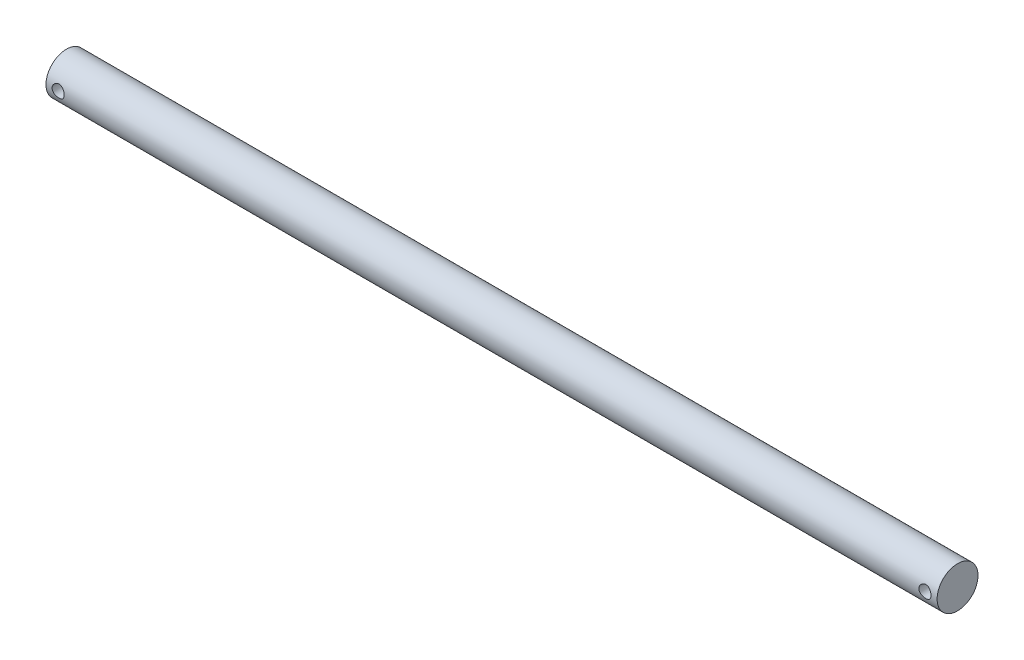
ISO-10303-21;
HEADER;
FILE_DESCRIPTION(('STEP AP214'),'2;1');
FILE_NAME('part.step','',(''),(''),'','','');
FILE_SCHEMA(('AUTOMOTIVE_DESIGN { 1 0 10303 214 1 1 1 1 }'));
ENDSEC;
DATA;
#1=APPLICATION_CONTEXT('core data for automotive mechanical design processes');
#2=APPLICATION_PROTOCOL_DEFINITION('international standard','automotive_design',2000,#1);
#3=PRODUCT_CONTEXT('',#1,'mechanical');
#4=PRODUCT('Part','Part','',(#3));
#5=PRODUCT_RELATED_PRODUCT_CATEGORY('part','',(#4));
#6=PRODUCT_DEFINITION_FORMATION('','',#4);
#7=PRODUCT_DEFINITION_CONTEXT('part definition',#1,'design');
#8=PRODUCT_DEFINITION('design','',#6,#7);
#9=PRODUCT_DEFINITION_SHAPE('','',#8);
#10=(LENGTH_UNIT() NAMED_UNIT(*) SI_UNIT(.MILLI.,.METRE.));
#11=(NAMED_UNIT(*) PLANE_ANGLE_UNIT() SI_UNIT($,.RADIAN.));
#12=(NAMED_UNIT(*) SI_UNIT($,.STERADIAN.) SOLID_ANGLE_UNIT());
#13=UNCERTAINTY_MEASURE_WITH_UNIT(LENGTH_MEASURE(1.E-05),#10,'distance_accuracy_value','');
#14=(GEOMETRIC_REPRESENTATION_CONTEXT(3) GLOBAL_UNCERTAINTY_ASSIGNED_CONTEXT((#13)) GLOBAL_UNIT_ASSIGNED_CONTEXT((#10,
#11,#12)) REPRESENTATION_CONTEXT('',''));
#15=CARTESIAN_POINT('',(0.,0.,0.));
#16=DIRECTION('',(0.,0.,1.));
#17=DIRECTION('',(1.,0.,0.));
#18=AXIS2_PLACEMENT_3D('',#15,#16,#17);
#19=CARTESIAN_POINT('',(220.,0.,1.11022302462516E-13));
#20=DIRECTION('',(-1.,0.,0.));
#21=DIRECTION('',(0.,0.,0.999999999999993));
#22=AXIS2_PLACEMENT_3D('',#19,#20,#21);
#23=CYLINDRICAL_SURFACE('',#22,5.05);
#24=CARTESIAN_POINT('',(220.,0.,1.11022302462516E-13));
#25=DIRECTION('',(1.,0.,0.));
#26=DIRECTION('',(0.,0.,-0.999999999999993));
#27=AXIS2_PLACEMENT_3D('',#24,#25,#26);
#28=CIRCLE('',#27,5.05);
#29=CARTESIAN_POINT('',(220.,0.,-5.04999999999985));
#30=VERTEX_POINT('',#29);
#31=EDGE_CURVE('E12',#30,#30,#28,.T.);
#32=ORIENTED_EDGE('',*,*,#31,.F.);
#33=EDGE_LOOP('',(#32));
#34=FACE_BOUND('',#33,.T.);
#35=CARTESIAN_POINT('',(0.,0.,0.));
#36=DIRECTION('',(1.,0.,0.));
#37=DIRECTION('',(0.,0.,-0.999999999999993));
#38=AXIS2_PLACEMENT_3D('',#35,#36,#37);
#39=CIRCLE('',#38,5.05);
#40=CARTESIAN_POINT('',(0.,0.,-5.04999999999997));
#41=VERTEX_POINT('',#40);
#42=EDGE_CURVE('E51',#41,#41,#39,.T.);
#43=ORIENTED_EDGE('',*,*,#42,.T.);
#44=EDGE_LOOP('',(#43));
#45=FACE_BOUND('',#44,.T.);
#46=CARTESIAN_POINT('',(218.5,0.,-5.04999999999989));
#47=CARTESIAN_POINT('',(218.499998901566,-0.082326160418582,-5.04999923011103));
#48=CARTESIAN_POINT('',(218.493199906321,-0.16466344686951,-5.04796755389246));
#49=CARTESIAN_POINT('',(218.466246566887,-0.326942670772421,-5.04006116488985));
#50=CARTESIAN_POINT('',(218.446088014145,-0.406883845099335,-5.03418524109121));
#51=CARTESIAN_POINT('',(218.393146265759,-0.562006610227521,-5.01923463892624));
#52=CARTESIAN_POINT('',(218.360381480856,-0.637194956703219,-5.01016462698686));
#53=CARTESIAN_POINT('',(218.283232172152,-0.781010548312461,-4.98977003019226));
#54=CARTESIAN_POINT('',(218.238846170946,-0.849636957711966,-4.97844515872081));
#55=CARTESIAN_POINT('',(218.138395202683,-0.980315968630887,-4.95439307126516));
#56=CARTESIAN_POINT('',(218.082062268464,-1.04215736577804,-4.94163754581403));
#57=CARTESIAN_POINT('',(217.959887794777,-1.15566881928641,-4.91633182231896));
#58=CARTESIAN_POINT('',(217.894044696308,-1.20733720469889,-4.90378165831617));
#59=CARTESIAN_POINT('',(217.752941371719,-1.30013964406602,-4.88000908188176));
#60=CARTESIAN_POINT('',(217.677506022777,-1.34101730031354,-4.86882190068005));
#61=CARTESIAN_POINT('',(217.520445978315,-1.40942102932551,-4.84946441956966));
#62=CARTESIAN_POINT('',(217.438822741239,-1.43695023698586,-4.84129341141757));
#63=CARTESIAN_POINT('',(217.274072675069,-1.47711663681718,-4.82918818737737));
#64=CARTESIAN_POINT('',(217.191048958307,-1.49014262075944,-4.82514361629097));
#65=CARTESIAN_POINT('',(217.023903645467,-1.5021467001094,-4.82142077827611));
#66=CARTESIAN_POINT('',(216.939782314228,-1.50112812385672,-4.82174147684725));
#67=CARTESIAN_POINT('',(216.77597909293,-1.48537767965771,-4.82661504660252));
#68=CARTESIAN_POINT('',(216.696245327932,-1.47113129415194,-4.83101808111304));
#69=CARTESIAN_POINT('',(216.540354800054,-1.43011337594599,-4.84331803969896));
#70=CARTESIAN_POINT('',(216.464198384697,-1.40334062912007,-4.85121530245069));
#71=CARTESIAN_POINT('',(216.316429646034,-1.33766889562819,-4.86973459046298));
#72=CARTESIAN_POINT('',(216.244892433828,-1.2986112804551,-4.88039191748511));
#73=CARTESIAN_POINT('',(216.109224102291,-1.20958879626925,-4.90321336757523));
#74=CARTESIAN_POINT('',(216.045094752861,-1.15962132886103,-4.91537784930266));
#75=CARTESIAN_POINT('',(215.923307011568,-1.04777973413156,-4.94045216385256));
#76=CARTESIAN_POINT('',(215.866020491011,-0.985502255264979,-4.95337213409724));
#77=CARTESIAN_POINT('',(215.762618816513,-0.852063652721403,-4.97806036748894));
#78=CARTESIAN_POINT('',(215.716504338371,-0.780901992032282,-4.98982856093904));
#79=CARTESIAN_POINT('',(215.636535929406,-0.631048588103442,-5.01099119024338));
#80=CARTESIAN_POINT('',(215.602763066874,-0.552311200701755,-5.0203698121635));
#81=CARTESIAN_POINT('',(215.549048118733,-0.389931061226177,-5.03558263041132));
#82=CARTESIAN_POINT('',(215.529102254352,-0.3062896561504,-5.04141779507394));
#83=CARTESIAN_POINT('',(215.504223286431,-0.139638248681586,-5.0487336974818));
#84=CARTESIAN_POINT('',(215.498786047404,-0.0567098105698311,-5.05036059697669));
#85=CARTESIAN_POINT('',(215.501667595796,0.108879283371184,-5.04950466681712));
#86=CARTESIAN_POINT('',(215.50998458654,0.191539972762494,-5.04702237393468));
#87=CARTESIAN_POINT('',(215.539730255316,0.352354025302251,-5.03832254952665));
#88=CARTESIAN_POINT('',(215.560865604256,0.430566596188185,-5.03218863615742));
#89=CARTESIAN_POINT('',(215.615296271192,0.58231950149226,-5.01689399636448));
#90=CARTESIAN_POINT('',(215.648593040147,0.655859277177384,-5.00773290878607));
#91=CARTESIAN_POINT('',(215.727255801921,0.798043779265182,-4.98707418020877));
#92=CARTESIAN_POINT('',(215.77287998766,0.866538416543269,-4.97552796924244));
#93=CARTESIAN_POINT('',(215.874587766343,0.995071648187684,-4.95142564055352));
#94=CARTESIAN_POINT('',(215.930673930287,1.05510815761559,-4.93886927502082));
#95=CARTESIAN_POINT('',(216.054081159495,1.16723211811501,-4.91360290721682));
#96=CARTESIAN_POINT('',(216.121730746245,1.21896110152571,-4.9009033121885));
#97=CARTESIAN_POINT('',(216.265025904656,1.31035617724057,-4.87726390384027));
#98=CARTESIAN_POINT('',(216.340671250165,1.35002261059947,-4.86632404077008));
#99=CARTESIAN_POINT('',(216.497552816262,1.41589077862864,-4.84756926093928));
#100=CARTESIAN_POINT('',(216.578759932838,1.44215731584663,-4.83973934586219));
#101=CARTESIAN_POINT('',(216.744719610225,1.48056745306896,-4.82812908103793));
#102=CARTESIAN_POINT('',(216.82947097655,1.49271577210026,-4.82434737820559));
#103=CARTESIAN_POINT('',(216.996394718514,1.50222816673898,-4.82139318549619));
#104=CARTESIAN_POINT('',(217.078531061191,1.50017577387829,-4.82203876123912));
#105=CARTESIAN_POINT('',(217.241231211561,1.4827342296224,-4.82743002961216));
#106=CARTESIAN_POINT('',(217.321795079804,1.46734559280676,-4.83217556404516));
#107=CARTESIAN_POINT('',(217.478130100408,1.42404171818053,-4.8451112281317));
#108=CARTESIAN_POINT('',(217.553946960841,1.39627810039671,-4.85325959180829));
#109=CARTESIAN_POINT('',(217.699906945793,1.32913019597829,-4.87207585849809));
#110=CARTESIAN_POINT('',(217.770048997878,1.28974371934246,-4.88274423626151));
#111=CARTESIAN_POINT('',(217.905383515056,1.1988169287536,-4.90587508316826));
#112=CARTESIAN_POINT('',(217.970308980268,1.14689207301151,-4.91838809823688));
#113=CARTESIAN_POINT('',(218.090714193743,1.03305826524241,-4.94354966874881));
#114=CARTESIAN_POINT('',(218.146191500332,0.9711467403989,-4.9561982583335));
#115=CARTESIAN_POINT('',(218.247697410525,0.836974206348418,-4.98063735032633));
#116=CARTESIAN_POINT('',(218.29341213999,0.764468781688054,-4.9923931829439));
#117=CARTESIAN_POINT('',(218.371937649682,0.612451878882696,-5.0133096665812));
#118=CARTESIAN_POINT('',(218.404754683609,0.532943819051205,-5.02247157471184));
#119=CARTESIAN_POINT('',(218.453483483763,0.378410556888165,-5.03633139201344));
#120=CARTESIAN_POINT('',(218.470880570631,0.303885645473268,-5.0414152475508));
#121=CARTESIAN_POINT('',(218.494138418016,0.152910148755271,-5.0482496429982));
#122=CARTESIAN_POINT('',(218.500001020164,0.0764598728361366,-5.05000071502903));
#123=CARTESIAN_POINT('',(218.5,0.,-5.04999999999989));
#124=B_SPLINE_CURVE_WITH_KNOTS('',3,(#46,#47,#48,#49,#50,#51,#52,#53,#54,#55,#56,#57,#58,#59,
#60,#61,#62,#63,#64,#65,#66,#67,#68,#69,#70,#71,#72,#73,#74,#75,#76,#77,#78,#79,#80,#81,#82,#83,
#84,#85,#86,#87,#88,#89,#90,#91,#92,#93,#94,#95,#96,#97,#98,#99,#100,#101,#102,#103,#104,#105,
#106,#107,#108,#109,#110,#111,#112,#113,#114,#115,#116,#117,#118,#119,#120,#121,#122,#123),
.UNSPECIFIED.,.T.,.F.,(4,2,2,2,2,2,2,2,2,2,2,2,2,2,2,2,2,2,2,2,2,2,2,2,2,2,2,2,2,2,2,2,2,2,2,2,
2,2,4),(0.,0.246697670123597,0.493473092373915,0.739889471764926,0.986337193275185,
1.23904357560802,1.49179143118415,1.7500925341995,2.00833294553728,2.25947019530706,
2.51054793052607,2.75276018096474,2.99499591284887,3.24049765531429,3.48605793274435,
3.74166021972898,3.99727796430425,4.25454582093267,4.51174334125772,4.7598799481168,
5.0079841441595,5.25061446471285,5.49327374254849,5.74147309529077,5.98973352281502,
6.24681969683831,6.50389860136996,6.75972218532314,7.0154602354006,7.26075384561192,
7.50603799157993,7.74839613565714,7.9907999745076,8.24187962953287,8.49302407258989,
8.75131666438498,9.00948386300116,9.23863927065425,9.46775808769527),.UNSPECIFIED.);
#125=CARTESIAN_POINT('',(218.5,0.,-5.04999999999989));
#126=VERTEX_POINT('',#125);
#127=EDGE_CURVE('E69',#126,#126,#124,.T.);
#128=ORIENTED_EDGE('',*,*,#127,.F.);
#129=EDGE_LOOP('',(#128));
#130=FACE_BOUND('',#129,.T.);
#131=CARTESIAN_POINT('',(215.5,0.,5.05));
#132=CARTESIAN_POINT('',(215.500001098435,0.0823261604185772,5.04999923011113));
#133=CARTESIAN_POINT('',(215.506800093679,0.164663446869489,5.04796755389265));
#134=CARTESIAN_POINT('',(215.533753433114,0.326942670772381,5.0400611648901));
#135=CARTESIAN_POINT('',(215.553911985856,0.406883845099294,5.03418524109144));
#136=CARTESIAN_POINT('',(215.606853734242,0.562006610227466,5.01923463892646));
#137=CARTESIAN_POINT('',(215.639618519144,0.63719495670315,5.01016462698709));
#138=CARTESIAN_POINT('',(215.716767827849,0.781010548312404,4.98977003019249));
#139=CARTESIAN_POINT('',(215.761153829055,0.849636957711937,4.97844515872102));
#140=CARTESIAN_POINT('',(215.861604797317,0.980315968630853,4.9543930712654));
#141=CARTESIAN_POINT('',(215.917937731537,1.04215736577796,4.9416375458143));
#142=CARTESIAN_POINT('',(216.040112205224,1.15566881928635,4.91633182231916));
#143=CARTESIAN_POINT('',(216.105955303693,1.20733720469889,4.90378165831627));
#144=CARTESIAN_POINT('',(216.247058628282,1.30013964406601,4.88000908188188));
#145=CARTESIAN_POINT('',(216.322493977224,1.34101730031346,4.86882190068031));
#146=CARTESIAN_POINT('',(216.479554021685,1.40942102932541,4.84946441956991));
#147=CARTESIAN_POINT('',(216.561177258761,1.43695023698581,4.84129341141767));
#148=CARTESIAN_POINT('',(216.725927324932,1.47711663681711,4.82918818737749));
#149=CARTESIAN_POINT('',(216.808951041694,1.4901426207593,4.82514361629123));
#150=CARTESIAN_POINT('',(216.976096354534,1.50214670010929,4.82142077827637));
#151=CARTESIAN_POINT('',(217.060217685773,1.50112812385674,4.82174147684736));
#152=CARTESIAN_POINT('',(217.224020907071,1.48537767965771,4.82661504660263));
#153=CARTESIAN_POINT('',(217.303754672068,1.47113129415181,4.8310180811133));
#154=CARTESIAN_POINT('',(217.459645199947,1.43011337594585,4.84331803969923));
#155=CARTESIAN_POINT('',(217.535801615304,1.40334062912003,4.85121530245081));
#156=CARTESIAN_POINT('',(217.683570353967,1.33766889562818,4.86973459046309));
#157=CARTESIAN_POINT('',(217.755107566172,1.29861128045499,4.88039191748535));
#158=CARTESIAN_POINT('',(217.890775897709,1.20958879626915,4.90321336757548));
#159=CARTESIAN_POINT('',(217.95490524714,1.15962132886104,4.91537784930277));
#160=CARTESIAN_POINT('',(218.076692988433,1.04777973413155,4.94045216385266));
#161=CARTESIAN_POINT('',(218.133979508989,0.985502255264842,4.95337213409748));
#162=CARTESIAN_POINT('',(218.237381183488,0.852063652721256,4.9780603674892));
#163=CARTESIAN_POINT('',(218.28349566163,0.78090199203225,4.98982856093916));
#164=CARTESIAN_POINT('',(218.363464070595,0.631048588103468,5.01099119024349));
#165=CARTESIAN_POINT('',(218.397236933126,0.552311200701723,5.02036981216372));
#166=CARTESIAN_POINT('',(218.450951881268,0.389931061226133,5.03558263041155));
#167=CARTESIAN_POINT('',(218.470897745649,0.306289656150402,5.04141779507405));
#168=CARTESIAN_POINT('',(218.49577671357,0.139638248681616,5.04873369748191));
#169=CARTESIAN_POINT('',(218.501213952597,0.0567098105698416,5.05036059697691));
#170=CARTESIAN_POINT('',(218.498332404205,-0.108879283371223,5.04950466681734));
#171=CARTESIAN_POINT('',(218.490015413461,-0.191539972762563,5.04702237393479));
#172=CARTESIAN_POINT('',(218.460269744685,-0.352354025302307,5.03832254952676));
#173=CARTESIAN_POINT('',(218.439134395745,-0.4305665961882,5.03218863615764));
#174=CARTESIAN_POINT('',(218.384703728809,-0.582319501492297,5.0168939963647));
#175=CARTESIAN_POINT('',(218.351406959854,-0.655859277177483,5.00773290878618));
#176=CARTESIAN_POINT('',(218.27274419808,-0.798043779265299,4.98707418020888));
#177=CARTESIAN_POINT('',(218.227120012341,-0.866538416543337,4.97552796924265));
#178=CARTESIAN_POINT('',(218.125412233657,-0.995071648187724,4.95142564055374));
#179=CARTESIAN_POINT('',(218.069326069714,-1.05510815761565,4.93886927502093));
#180=CARTESIAN_POINT('',(217.945918840506,-1.16723211811513,4.91360290721692));
#181=CARTESIAN_POINT('',(217.878269253756,-1.21896110152585,4.90090331218871));
#182=CARTESIAN_POINT('',(217.734974095345,-1.31035617724071,4.87726390384042));
#183=CARTESIAN_POINT('',(217.659328749836,-1.35002261059957,4.86632404077008));
#184=CARTESIAN_POINT('',(217.502447183738,-1.41589077862872,4.84756926093928));
#185=CARTESIAN_POINT('',(217.421240067163,-1.44215731584674,4.83973934586235));
#186=CARTESIAN_POINT('',(217.255280389776,-1.48056745306906,4.82812908103815));
#187=CARTESIAN_POINT('',(217.170529023451,-1.4927157721003,4.82434737820572));
#188=CARTESIAN_POINT('',(217.003605281487,-1.50222816673907,4.82139318549628));
#189=CARTESIAN_POINT('',(216.92146893881,-1.50017577387847,4.82203876123926));
#190=CARTESIAN_POINT('',(216.75876878844,-1.48273422962255,4.82743002961237));
#191=CARTESIAN_POINT('',(216.678204920197,-1.46734559280679,4.83217556404539));
#192=CARTESIAN_POINT('',(216.521869899593,-1.42404171818062,4.84511122813192));
#193=CARTESIAN_POINT('',(216.44605303916,-1.39627810039696,4.85325959180847));
#194=CARTESIAN_POINT('',(216.300093054208,-1.32913019597852,4.87207585849822));
#195=CARTESIAN_POINT('',(216.229951002123,-1.28974371934252,4.88274423626162));
#196=CARTESIAN_POINT('',(216.094616484945,-1.19881692875364,4.90587508316839));
#197=CARTESIAN_POINT('',(216.029691019733,-1.14689207301172,4.91838809823706));
#198=CARTESIAN_POINT('',(215.909285806257,-1.03305826524262,4.94354966874898));
#199=CARTESIAN_POINT('',(215.853808499668,-0.971146740398934,4.95619825833359));
#200=CARTESIAN_POINT('',(215.752302589476,-0.836974206348376,4.98063735032644));
#201=CARTESIAN_POINT('',(215.70658786001,-0.76446878168812,4.99239318294412));
#202=CARTESIAN_POINT('',(215.628062350318,-0.612451878882778,5.0133096665814));
#203=CARTESIAN_POINT('',(215.595245316392,-0.532943819051195,5.02247157471194));
#204=CARTESIAN_POINT('',(215.546516516238,-0.378410556888123,5.03633139201356));
#205=CARTESIAN_POINT('',(215.52911942937,-0.303885645473271,5.04141524755102));
#206=CARTESIAN_POINT('',(215.505861581984,-0.1529101487553,5.04824964299842));
#207=CARTESIAN_POINT('',(215.499998979837,-0.0764598728361459,5.05000071502916));
#208=CARTESIAN_POINT('',(215.5,0.,5.05));
#209=B_SPLINE_CURVE_WITH_KNOTS('',3,(#131,#132,#133,#134,#135,#136,#137,#138,#139,#140,#141,
#142,#143,#144,#145,#146,#147,#148,#149,#150,#151,#152,#153,#154,#155,#156,#157,#158,#159,#160,
#161,#162,#163,#164,#165,#166,#167,#168,#169,#170,#171,#172,#173,#174,#175,#176,#177,#178,#179,
#180,#181,#182,#183,#184,#185,#186,#187,#188,#189,#190,#191,#192,#193,#194,#195,#196,#197,#198,
#199,#200,#201,#202,#203,#204,#205,#206,#207,#208),.UNSPECIFIED.,.T.,.F.,(4,2,2,2,2,2,2,2,2,2,2,
2,2,2,2,2,2,2,2,2,2,2,2,2,2,2,2,2,2,2,2,2,2,2,2,2,2,2,4),(0.,0.246697670123561,
0.493473092373848,0.739889471764878,0.986337193275122,1.23904357560802,1.49179143118416,
1.7500925341995,2.0083329455373,2.25947019530714,2.51054793052618,2.7527601809646,
2.99499591284858,3.24049765531413,3.48605793274437,3.74166021972895,3.99727796430418,
4.25454582093256,4.51174334125758,4.7598799481167,5.00798414415944,5.25061446471278,
5.4932737425484,5.74147309529074,5.98973352281504,6.24681969683842,6.50389860137009,
6.75972218532305,7.01546023540039,7.2607538456118,7.5060379915798,7.74839613565692,
7.99079997450734,8.24187962953276,8.49302407258994,8.75131666438502,9.00948386300121,
9.23863927065431,9.46775808769534),.UNSPECIFIED.);
#210=CARTESIAN_POINT('',(215.5,0.,5.05));
#211=VERTEX_POINT('',#210);
#212=EDGE_CURVE('E60',#211,#211,#209,.T.);
#213=ORIENTED_EDGE('',*,*,#212,.T.);
#214=EDGE_LOOP('',(#213));
#215=FACE_BOUND('',#214,.T.);
#216=CARTESIAN_POINT('',(4.50000000000001,0.,-5.04999999999999));
#217=CARTESIAN_POINT('',(4.49999890156555,-0.0823261604185564,-5.04999923011113));
#218=CARTESIAN_POINT('',(4.49319990632082,-0.164663446869465,-5.04796755389243));
#219=CARTESIAN_POINT('',(4.46624656688674,-0.326942670772386,-5.04006116488988));
#220=CARTESIAN_POINT('',(4.44608801414458,-0.40688384509933,-5.03418524109142));
#221=CARTESIAN_POINT('',(4.39314626575872,-0.562006610227512,-5.01923463892646));
#222=CARTESIAN_POINT('',(4.36038148085612,-0.637194956703174,-5.01016462698689));
#223=CARTESIAN_POINT('',(4.28323217215156,-0.781010548312433,-4.98977003019223));
#224=CARTESIAN_POINT('',(4.23884617094526,-0.849636957711991,-4.9784451587209));
#225=CARTESIAN_POINT('',(4.13839520268281,-0.980315968630905,-4.95439307126529));
#226=CARTESIAN_POINT('',(4.08206226846375,-1.04215736577799,-4.94163754581407));
#227=CARTESIAN_POINT('',(3.95988779477627,-1.15566881928636,-4.91633182231893));
#228=CARTESIAN_POINT('',(3.89404469630777,-1.20733720469891,-4.90378165831616));
#229=CARTESIAN_POINT('',(3.75294137171826,-1.30013964406605,-4.88000908188175));
#230=CARTESIAN_POINT('',(3.67750602277634,-1.34101730031351,-4.86882190068004));
#231=CARTESIAN_POINT('',(3.52044597831491,-1.40942102932544,-4.84946441956971));
#232=CARTESIAN_POINT('',(3.43882274123891,-1.43695023698581,-4.84129341141768));
#233=CARTESIAN_POINT('',(3.27407267506837,-1.47711663681715,-4.82918818737748));
#234=CARTESIAN_POINT('',(3.19104895830643,-1.49014262075941,-4.82514361629101));
#235=CARTESIAN_POINT('',(3.02390364546676,-1.50214670010935,-4.82142077827609));
#236=CARTESIAN_POINT('',(2.93978231422725,-1.50112812385664,-4.82174147684724));
#237=CARTESIAN_POINT('',(2.7759790929295,-1.48537767965765,-4.82661504660252));
#238=CARTESIAN_POINT('',(2.69624532793204,-1.47113129415191,-4.83101808111304));
#239=CARTESIAN_POINT('',(2.54035480005338,-1.430113375946,-4.84331803969896));
#240=CARTESIAN_POINT('',(2.46419838469668,-1.40334062912007,-4.85121530245068));
#241=CARTESIAN_POINT('',(2.31642964603342,-1.33766889562819,-4.86973459046298));
#242=CARTESIAN_POINT('',(2.24489243382779,-1.2986112804551,-4.88039191748511));
#243=CARTESIAN_POINT('',(2.10922410229097,-1.20958879626923,-4.90321336757523));
#244=CARTESIAN_POINT('',(2.04509475286082,-1.15962132886101,-4.91537784930265));
#245=CARTESIAN_POINT('',(1.92330701156717,-1.04777973413151,-4.94045216385255));
#246=CARTESIAN_POINT('',(1.86602049101084,-0.985502255264918,-4.95337213409725));
#247=CARTESIAN_POINT('',(1.76261881651248,-0.852063652721356,-4.97806036748895));
#248=CARTESIAN_POINT('',(1.7165043383702,-0.780901992032263,-4.98982856093903));
#249=CARTESIAN_POINT('',(1.63653592940555,-0.631048588103428,-5.01099119024337));
#250=CARTESIAN_POINT('',(1.60276306687404,-0.552311200701718,-5.0203698121635));
#251=CARTESIAN_POINT('',(1.54904811873248,-0.389931061226158,-5.03558263041133));
#252=CARTESIAN_POINT('',(1.52910225435156,-0.306289656150423,-5.04141779507394));
#253=CARTESIAN_POINT('',(1.50422328643068,-0.13963824868164,-5.04873369748178));
#254=CARTESIAN_POINT('',(1.49878604740346,-0.056709810569874,-5.05036059697666));
#255=CARTESIAN_POINT('',(1.50166759579561,0.108879283371168,-5.04950466681715));
#256=CARTESIAN_POINT('',(1.50998458653922,0.191539972762494,-5.04702237393479));
#257=CARTESIAN_POINT('',(1.53973025531578,0.352354025302239,-5.03832254952675));
#258=CARTESIAN_POINT('',(1.56086560425527,0.430566596188146,-5.03218863615742));
#259=CARTESIAN_POINT('',(1.61529627119128,0.582319501492243,-5.01689399636448));
#260=CARTESIAN_POINT('',(1.64859304014664,0.655859277177416,-5.00773290878616));
#261=CARTESIAN_POINT('',(1.72725580192079,0.798043779265222,-4.98707418020888));
#262=CARTESIAN_POINT('',(1.77287998765979,0.866538416543264,-4.97552796924247));
#263=CARTESIAN_POINT('',(1.87458776634302,0.995071648187709,-4.95142564055349));
#264=CARTESIAN_POINT('',(1.93067393028647,1.05510815761569,-4.93886927502081));
#265=CARTESIAN_POINT('',(2.05408115949448,1.16723211811512,-4.91360290721682));
#266=CARTESIAN_POINT('',(2.12173074624445,1.21896110152574,-4.90090331218849));
#267=CARTESIAN_POINT('',(2.26502590465565,1.3103561772406,-4.87726390384026));
#268=CARTESIAN_POINT('',(2.34067125016449,1.35002261059955,-4.86632404077008));
#269=CARTESIAN_POINT('',(2.49755281626173,1.41589077862873,-4.84756926093927));
#270=CARTESIAN_POINT('',(2.57875993283747,1.44215731584667,-4.83973934586216));
#271=CARTESIAN_POINT('',(2.74471961022464,1.48056745306891,-4.82812908103797));
#272=CARTESIAN_POINT('',(2.82947097654907,1.49271577210016,-4.82434737820572));
#273=CARTESIAN_POINT('',(2.99639471851292,1.50222816673895,-4.82139318549627));
#274=CARTESIAN_POINT('',(3.07853106119064,1.50017577387836,-4.82203876123909));
#275=CARTESIAN_POINT('',(3.2412312115601,1.48273422962249,-4.82743002961215));
#276=CARTESIAN_POINT('',(3.32179507980319,1.46734559280677,-4.83217556404527));
#277=CARTESIAN_POINT('',(3.47813010040777,1.42404171818058,-4.8451112281318));
#278=CARTESIAN_POINT('',(3.55394696084027,1.39627810039685,-4.85325959180825));
#279=CARTESIAN_POINT('',(3.69990694579247,1.3291301959784,-4.87207585849806));
#280=CARTESIAN_POINT('',(3.77004899787753,1.28974371934245,-4.88274423626161));
#281=CARTESIAN_POINT('',(3.9053835150558,1.19881692875358,-4.90587508316837));
#282=CARTESIAN_POINT('',(3.97030898026753,1.14689207301161,-4.91838809823686));
#283=CARTESIAN_POINT('',(4.09071419374288,1.03305826524252,-4.94354966874879));
#284=CARTESIAN_POINT('',(4.1461915003319,0.971146740398892,-4.95619825833359));
#285=CARTESIAN_POINT('',(4.24769741052438,0.836974206348375,-4.98063735032644));
#286=CARTESIAN_POINT('',(4.29341213999004,0.764468781688095,-4.9923931829439));
#287=CARTESIAN_POINT('',(4.37193764968208,0.612451878882743,-5.01330966658119));
#288=CARTESIAN_POINT('',(4.40475468360832,0.532943819051174,-5.02247157471195));
#289=CARTESIAN_POINT('',(4.45348348376197,0.378410556888112,-5.03633139201354));
#290=CARTESIAN_POINT('',(4.47088057063036,0.303885645473258,-5.0414152475508));
#291=CARTESIAN_POINT('',(4.49413841801595,0.152910148755297,-5.04824964299821));
#292=CARTESIAN_POINT('',(4.50000102016369,0.0764598728361537,-5.05000071502914));
#293=CARTESIAN_POINT('',(4.50000000000001,0.,-5.04999999999999));
#294=B_SPLINE_CURVE_WITH_KNOTS('',3,(#216,#217,#218,#219,#220,#221,#222,#223,#224,#225,#226,
#227,#228,#229,#230,#231,#232,#233,#234,#235,#236,#237,#238,#239,#240,#241,#242,#243,#244,#245,
#246,#247,#248,#249,#250,#251,#252,#253,#254,#255,#256,#257,#258,#259,#260,#261,#262,#263,#264,
#265,#266,#267,#268,#269,#270,#271,#272,#273,#274,#275,#276,#277,#278,#279,#280,#281,#282,#283,
#284,#285,#286,#287,#288,#289,#290,#291,#292,#293),.UNSPECIFIED.,.T.,.F.,(4,2,2,2,2,2,2,2,2,2,2,
2,2,2,2,2,2,2,2,2,2,2,2,2,2,2,2,2,2,2,2,2,2,2,2,2,2,2,4),(0.,0.24669767012358,0.493473092373873,
0.739889471764938,0.986337193275254,1.23904357560805,1.49179143118409,1.7500925341995,
2.0083329455374,2.25947019530711,2.51054793052603,2.75276018096462,2.99499591284874,
3.24049765531422,3.48605793274439,3.74166021972901,3.99727796430428,4.25454582093268,
4.51174334125771,4.75987994811679,5.0079841441595,5.25061446471285,5.49327374254847,
5.74147309529082,5.98973352281515,6.24681969683841,6.50389860137,6.75972218532305,
7.01546023540041,7.26075384561178,7.50603799157981,7.74839613565703,7.99079997450751,
8.24187962953286,8.49302407258993,8.75131666438502,9.00948386300122,9.23863927065429,
9.4677580876953),.UNSPECIFIED.);
#295=CARTESIAN_POINT('',(4.50000000000001,0.,-5.04999999999999));
#296=VERTEX_POINT('',#295);
#297=EDGE_CURVE('E68',#296,#296,#294,.T.);
#298=ORIENTED_EDGE('',*,*,#297,.F.);
#299=EDGE_LOOP('',(#298));
#300=FACE_BOUND('',#299,.T.);
#301=CARTESIAN_POINT('',(1.50000000000002,0.,5.05));
#302=CARTESIAN_POINT('',(1.50000109843448,0.0823261604185461,5.04999923011113));
#303=CARTESIAN_POINT('',(1.50680009367918,0.164663446869462,5.04796755389265));
#304=CARTESIAN_POINT('',(1.53375343311326,0.326942670772375,5.0400611648901));
#305=CARTESIAN_POINT('',(1.55391198585543,0.406883845099304,5.03418524109144));
#306=CARTESIAN_POINT('',(1.6068537342413,0.562006610227495,5.01923463892647));
#307=CARTESIAN_POINT('',(1.63961851914391,0.637194956703181,5.01016462698711));
#308=CARTESIAN_POINT('',(1.71676782784846,0.781010548312444,4.98977003019245));
#309=CARTESIAN_POINT('',(1.76115382905474,0.849636957711982,4.97844515872091));
#310=CARTESIAN_POINT('',(1.86160479731721,0.980315968630891,4.9543930712653));
#311=CARTESIAN_POINT('',(1.91793773153629,1.042157365778,4.94163754581429));
#312=CARTESIAN_POINT('',(2.04011220522376,1.15566881928636,4.91633182231916));
#313=CARTESIAN_POINT('',(2.10595530369225,1.20733720469888,4.90378165831617));
#314=CARTESIAN_POINT('',(2.24705862828176,1.30013964406601,4.88000908188176));
#315=CARTESIAN_POINT('',(2.32249397722371,1.34101730031349,4.86882190068027));
#316=CARTESIAN_POINT('',(2.47955402168514,1.40942102932544,4.84946441956994));
#317=CARTESIAN_POINT('',(2.56117725876112,1.4369502369858,4.84129341141769));
#318=CARTESIAN_POINT('',(2.72592732493165,1.47711663681712,4.82918818737749));
#319=CARTESIAN_POINT('',(2.8089510416936,1.49014262075938,4.82514361629122));
#320=CARTESIAN_POINT('',(2.97609635453327,1.50214670010932,4.82142077827635));
#321=CARTESIAN_POINT('',(3.06021768577278,1.50112812385663,4.82174147684736));
#322=CARTESIAN_POINT('',(3.22402090707052,1.48537767965763,4.82661504660264));
#323=CARTESIAN_POINT('',(3.30375467206796,1.47113129415187,4.8310180811133));
#324=CARTESIAN_POINT('',(3.45964519994662,1.43011337594595,4.84331803969917));
#325=CARTESIAN_POINT('',(3.53580161530335,1.40334062912004,4.8512153024507));
#326=CARTESIAN_POINT('',(3.68357035396659,1.33766889562817,4.86973459046299));
#327=CARTESIAN_POINT('',(3.75510756617219,1.29861128045507,4.88039191748531));
#328=CARTESIAN_POINT('',(3.89077589770901,1.2095887962692,4.90321336757549));
#329=CARTESIAN_POINT('',(3.95490524713918,1.15962132886098,4.91537784930279));
#330=CARTESIAN_POINT('',(4.07669298843283,1.04777973413149,4.94045216385266));
#331=CARTESIAN_POINT('',(4.13397950898914,0.985502255264896,4.95337213409747));
#332=CARTESIAN_POINT('',(4.23738118348751,0.852063652721337,4.97806036748918));
#333=CARTESIAN_POINT('',(4.28349566162981,0.780901992032242,4.98982856093915));
#334=CARTESIAN_POINT('',(4.36346407059446,0.631048588103413,5.01099119024351));
#335=CARTESIAN_POINT('',(4.39723693312594,0.552311200701709,5.02036981216375));
#336=CARTESIAN_POINT('',(4.45095188126751,0.389931061226148,5.03558263041152));
#337=CARTESIAN_POINT('',(4.47089774564844,0.306289656150405,5.04141779507395));
#338=CARTESIAN_POINT('',(4.49577671356932,0.139638248681615,5.04873369748181));
#339=CARTESIAN_POINT('',(4.50121395259653,0.0567098105698496,5.05036059697688));
#340=CARTESIAN_POINT('',(4.4983324042044,-0.108879283371189,5.04950466681737));
#341=CARTESIAN_POINT('',(4.49001541346082,-0.191539972762513,5.0470223739348));
#342=CARTESIAN_POINT('',(4.46026974468426,-0.352354025302265,5.03832254952676));
#343=CARTESIAN_POINT('',(4.43913439574473,-0.430566596188182,5.03218863615764));
#344=CARTESIAN_POINT('',(4.38470372880871,-0.582319501492277,5.0168939963647));
#345=CARTESIAN_POINT('',(4.35140695985336,-0.65585927717744,5.00773290878619));
#346=CARTESIAN_POINT('',(4.27274419807922,-0.79804377926525,4.98707418020888));
#347=CARTESIAN_POINT('',(4.2271200123402,-0.866538416543307,4.97552796924265));
#348=CARTESIAN_POINT('',(4.12541223365697,-0.995071648187758,4.95142564055374));
#349=CARTESIAN_POINT('',(4.06932606971354,-1.05510815761573,4.93886927502094));
#350=CARTESIAN_POINT('',(3.94591884050553,-1.16723211811515,4.91360290721694));
#351=CARTESIAN_POINT('',(3.87826925375555,-1.21896110152578,4.90090331218873));
#352=CARTESIAN_POINT('',(3.73497409534435,-1.31035617724063,4.87726390384044));
#353=CARTESIAN_POINT('',(3.65932874983553,-1.35002261059958,4.86632404077009));
#354=CARTESIAN_POINT('',(3.50244718373828,-1.41589077862876,4.84756926093929));
#355=CARTESIAN_POINT('',(3.42124006716254,-1.4421573158467,4.83973934586237));
#356=CARTESIAN_POINT('',(3.25528038977535,-1.48056745306895,4.82812908103817));
#357=CARTESIAN_POINT('',(3.17052902345092,-1.49271577210021,4.82434737820572));
#358=CARTESIAN_POINT('',(3.00360528148708,-1.502228166739,4.82139318549629));
#359=CARTESIAN_POINT('',(2.92146893880938,-1.50017577387841,4.8220387612393));
#360=CARTESIAN_POINT('',(2.75876878843993,-1.48273422962252,4.82743002961236));
#361=CARTESIAN_POINT('',(2.67820492019684,-1.46734559280678,4.83217556404529));
#362=CARTESIAN_POINT('',(2.52186989959227,-1.4240417181806,4.84511122813182));
#363=CARTESIAN_POINT('',(2.44605303915977,-1.39627810039691,4.85325959180846));
#364=CARTESIAN_POINT('',(2.30009305420756,-1.32913019597846,4.87207585849826));
#365=CARTESIAN_POINT('',(2.22995100212249,-1.28974371934247,4.88274423626163));
#366=CARTESIAN_POINT('',(2.09461648494422,-1.1988169287536,4.90587508316838));
#367=CARTESIAN_POINT('',(2.02969101973249,-1.14689207301166,4.91838809823707));
#368=CARTESIAN_POINT('',(1.90928580625713,-1.03305826524258,4.943549668749));
#369=CARTESIAN_POINT('',(1.85380849966811,-0.971146740398921,4.95619825833361));
#370=CARTESIAN_POINT('',(1.75230258947562,-0.836974206348397,4.98063735032645));
#371=CARTESIAN_POINT('',(1.70658786000995,-0.764468781688145,4.99239318294411));
#372=CARTESIAN_POINT('',(1.62806235031794,-0.612451878882793,5.0133096665814));
#373=CARTESIAN_POINT('',(1.5952453163917,-0.532943819051195,5.02247157471195));
#374=CARTESIAN_POINT('',(1.54651651623804,-0.378410556888125,5.03633139201357));
#375=CARTESIAN_POINT('',(1.52911942936964,-0.303885645473286,5.04141524755102));
#376=CARTESIAN_POINT('',(1.50586158198405,-0.152910148755331,5.04824964299842));
#377=CARTESIAN_POINT('',(1.49999897983633,-0.076459872836179,5.05000071502916));
#378=CARTESIAN_POINT('',(1.50000000000002,0.,5.05));
#379=B_SPLINE_CURVE_WITH_KNOTS('',3,(#301,#302,#303,#304,#305,#306,#307,#308,#309,#310,#311,
#312,#313,#314,#315,#316,#317,#318,#319,#320,#321,#322,#323,#324,#325,#326,#327,#328,#329,#330,
#331,#332,#333,#334,#335,#336,#337,#338,#339,#340,#341,#342,#343,#344,#345,#346,#347,#348,#349,
#350,#351,#352,#353,#354,#355,#356,#357,#358,#359,#360,#361,#362,#363,#364,#365,#366,#367,#368,
#369,#370,#371,#372,#373,#374,#375,#376,#377,#378),.UNSPECIFIED.,.T.,.F.,(4,2,2,2,2,2,2,2,2,2,2,
2,2,2,2,2,2,2,2,2,2,2,2,2,2,2,2,2,2,2,2,2,2,2,2,2,2,2,4),(0.,0.246697670123582,
0.493473092373879,0.739889471764954,0.986337193275277,1.23904357560806,1.4917914311841,
1.75009253419952,2.00833294553741,2.25947019530711,2.51054793052602,2.75276018096461,
2.99499591284872,3.2404976553142,3.48605793274436,3.74166021972898,3.99727796430425,
4.25454582093264,4.51174334125768,4.75987994811676,5.00798414415948,5.25061446471284,
5.49327374254847,5.74147309529082,5.98973352281513,6.24681969683839,6.50389860136997,
6.75972218532304,7.01546023540041,7.26075384561176,7.50603799157976,7.74839613565698,
7.99079997450747,8.24187962953282,8.49302407258991,8.751316664385,9.0094838630012,
9.23863927065429,9.4677580876953),.UNSPECIFIED.);
#380=CARTESIAN_POINT('',(1.50000000000002,0.,5.05));
#381=VERTEX_POINT('',#380);
#382=EDGE_CURVE('E58',#381,#381,#379,.T.);
#383=ORIENTED_EDGE('',*,*,#382,.T.);
#384=EDGE_LOOP('',(#383));
#385=FACE_BOUND('',#384,.T.);
#386=ADVANCED_FACE('F48',(#34,#45,#130,#215,#300,#385),#23,.T.);
#387=CARTESIAN_POINT('',(220.,0.,1.11022302462516E-13));
#388=DIRECTION('',(1.,0.,0.));
#389=DIRECTION('',(0.,0.,-0.999999999999993));
#390=AXIS2_PLACEMENT_3D('',#387,#388,#389);
#391=PLANE('',#390);
#392=ORIENTED_EDGE('',*,*,#31,.T.);
#393=EDGE_LOOP('',(#392));
#394=FACE_BOUND('',#393,.T.);
#395=ADVANCED_FACE('F107',(#394),#391,.T.);
#396=CARTESIAN_POINT('',(0.,0.,0.));
#397=DIRECTION('',(1.,0.,0.));
#398=DIRECTION('',(0.,0.,-0.999999999999993));
#399=AXIS2_PLACEMENT_3D('',#396,#397,#398);
#400=PLANE('',#399);
#401=ORIENTED_EDGE('',*,*,#42,.F.);
#402=EDGE_LOOP('',(#401));
#403=FACE_BOUND('',#402,.T.);
#404=ADVANCED_FACE('F113',(#403),#400,.F.);
#405=CARTESIAN_POINT('',(217.,0.,5.05100000000003));
#406=DIRECTION('',(0.,0.,-0.999999999999993));
#407=DIRECTION('',(-1.,0.,0.));
#408=AXIS2_PLACEMENT_3D('',#405,#406,#407);
#409=CYLINDRICAL_SURFACE('',#408,1.5);
#410=ORIENTED_EDGE('',*,*,#212,.F.);
#411=EDGE_LOOP('',(#410));
#412=FACE_BOUND('',#411,.T.);
#413=ORIENTED_EDGE('',*,*,#127,.T.);
#414=EDGE_LOOP('',(#413));
#415=FACE_BOUND('',#414,.T.);
#416=ADVANCED_FACE('F76',(#412,#415),#409,.F.);
#417=CARTESIAN_POINT('',(3.00000000000002,0.,5.05100000000003));
#418=DIRECTION('',(0.,0.,-0.999999999999993));
#419=DIRECTION('',(-1.,0.,0.));
#420=AXIS2_PLACEMENT_3D('',#417,#418,#419);
#421=CYLINDRICAL_SURFACE('',#420,1.5);
#422=ORIENTED_EDGE('',*,*,#382,.F.);
#423=EDGE_LOOP('',(#422));
#424=FACE_BOUND('',#423,.T.);
#425=ORIENTED_EDGE('',*,*,#297,.T.);
#426=EDGE_LOOP('',(#425));
#427=FACE_BOUND('',#426,.T.);
#428=ADVANCED_FACE('F83',(#424,#427),#421,.F.);
#429=CLOSED_SHELL('',(#386,#395,#404,#416,#428));
#430=MANIFOLD_SOLID_BREP('B2',#429);
#431=ADVANCED_BREP_SHAPE_REPRESENTATION('',(#18,#430),#14);
#432=SHAPE_DEFINITION_REPRESENTATION(#9,#431);
ENDSEC;
END-ISO-10303-21;
